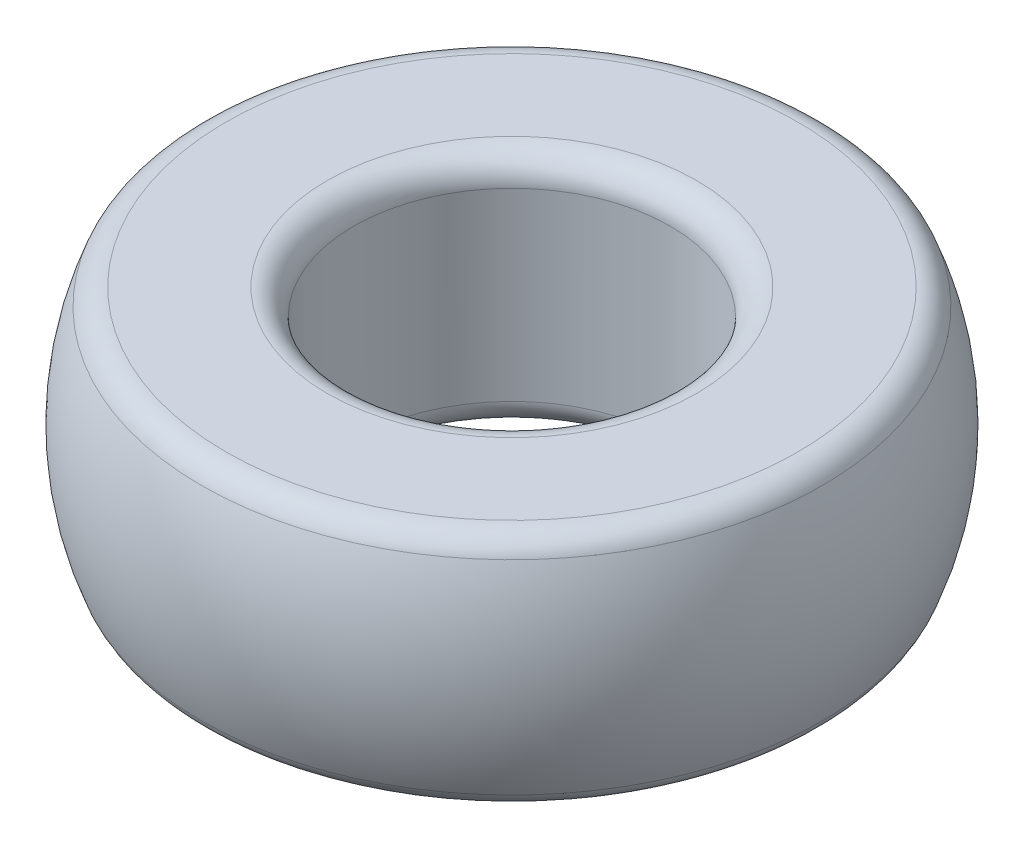
ISO-10303-21;
HEADER;
FILE_DESCRIPTION(('STEP AP214'),'2;1');
FILE_NAME('part.step','',(''),(''),'','','');
FILE_SCHEMA(('AUTOMOTIVE_DESIGN { 1 0 10303 214 1 1 1 1 }'));
ENDSEC;
DATA;
#1=APPLICATION_CONTEXT('core data for automotive mechanical design processes');
#2=APPLICATION_PROTOCOL_DEFINITION('international standard','automotive_design',2000,#1);
#3=PRODUCT_CONTEXT('',#1,'mechanical');
#4=PRODUCT('Part','Part','',(#3));
#5=PRODUCT_RELATED_PRODUCT_CATEGORY('part','',(#4));
#6=PRODUCT_DEFINITION_FORMATION('','',#4);
#7=PRODUCT_DEFINITION_CONTEXT('part definition',#1,'design');
#8=PRODUCT_DEFINITION('design','',#6,#7);
#9=PRODUCT_DEFINITION_SHAPE('','',#8);
#10=(LENGTH_UNIT() NAMED_UNIT(*) SI_UNIT(.MILLI.,.METRE.));
#11=(NAMED_UNIT(*) PLANE_ANGLE_UNIT() SI_UNIT($,.RADIAN.));
#12=(NAMED_UNIT(*) SI_UNIT($,.STERADIAN.) SOLID_ANGLE_UNIT());
#13=UNCERTAINTY_MEASURE_WITH_UNIT(LENGTH_MEASURE(1.E-05),#10,'distance_accuracy_value','');
#14=(GEOMETRIC_REPRESENTATION_CONTEXT(3) GLOBAL_UNCERTAINTY_ASSIGNED_CONTEXT((#13)) GLOBAL_UNIT_ASSIGNED_CONTEXT((#10,
#11,#12)) REPRESENTATION_CONTEXT('',''));
#15=CARTESIAN_POINT('',(0.,0.,0.));
#16=DIRECTION('',(0.,0.,1.));
#17=DIRECTION('',(1.,0.,0.));
#18=AXIS2_PLACEMENT_3D('',#15,#16,#17);
#19=CARTESIAN_POINT('',(6.,-4.5,0.));
#20=DIRECTION('',(0.,-1.,0.));
#21=DIRECTION('',(0.,0.,-1.));
#22=AXIS2_PLACEMENT_3D('',#19,#20,#21);
#23=PLANE('',#22);
#24=CARTESIAN_POINT('',(0.,-4.5,0.));
#25=DIRECTION('',(0.,-1.,0.));
#26=DIRECTION('',(0.,0.,-1.));
#27=AXIS2_PLACEMENT_3D('',#24,#25,#26);
#28=CIRCLE('',#27,7.);
#29=CARTESIAN_POINT('',(0.,-4.5,-7.));
#30=VERTEX_POINT('',#29);
#31=EDGE_CURVE('E52',#30,#30,#28,.F.);
#32=ORIENTED_EDGE('',*,*,#31,.T.);
#33=EDGE_LOOP('',(#32));
#34=FACE_BOUND('',#33,.T.);
#35=CARTESIAN_POINT('',(0.,-4.5,0.));
#36=DIRECTION('',(0.,-1.,0.));
#37=DIRECTION('',(0.,0.,-1.));
#38=AXIS2_PLACEMENT_3D('',#35,#36,#37);
#39=CIRCLE('',#38,10.8410819202146);
#40=CARTESIAN_POINT('',(0.,-4.5,-10.8410819202146));
#41=VERTEX_POINT('',#40);
#42=EDGE_CURVE('E55',#41,#41,#39,.T.);
#43=ORIENTED_EDGE('',*,*,#42,.T.);
#44=EDGE_LOOP('',(#43));
#45=FACE_BOUND('',#44,.T.);
#46=ADVANCED_FACE('F32',(#34,#45),#23,.T.);
#47=CARTESIAN_POINT('',(0.,-5.95711549427499,0.));
#48=DIRECTION('',(0.,-1.,0.));
#49=DIRECTION('',(0.,0.,-1.));
#50=AXIS2_PLACEMENT_3D('',#47,#48,#49);
#51=CYLINDRICAL_SURFACE('',#50,6.);
#52=CARTESIAN_POINT('',(0.,-3.5,0.));
#53=DIRECTION('',(0.,-1.,0.));
#54=DIRECTION('',(0.,0.,-1.));
#55=AXIS2_PLACEMENT_3D('',#52,#53,#54);
#56=CIRCLE('',#55,6.);
#57=CARTESIAN_POINT('',(0.,-3.5,-6.));
#58=VERTEX_POINT('',#57);
#59=EDGE_CURVE('E58',#58,#58,#56,.T.);
#60=ORIENTED_EDGE('',*,*,#59,.T.);
#61=EDGE_LOOP('',(#60));
#62=FACE_BOUND('',#61,.T.);
#63=CARTESIAN_POINT('',(0.,3.5,0.));
#64=DIRECTION('',(0.,1.,0.));
#65=DIRECTION('',(0.,0.,1.));
#66=AXIS2_PLACEMENT_3D('',#63,#64,#65);
#67=CIRCLE('',#66,6.);
#68=CARTESIAN_POINT('',(0.,3.5,6.));
#69=VERTEX_POINT('',#68);
#70=EDGE_CURVE('E61',#69,#69,#67,.T.);
#71=ORIENTED_EDGE('',*,*,#70,.T.);
#72=EDGE_LOOP('',(#71));
#73=FACE_BOUND('',#72,.T.);
#74=ADVANCED_FACE('F65',(#62,#73),#51,.F.);
#75=CARTESIAN_POINT('',(11.5,4.5,0.));
#76=DIRECTION('',(0.,1.,0.));
#77=DIRECTION('',(0.,0.,1.));
#78=AXIS2_PLACEMENT_3D('',#75,#76,#77);
#79=PLANE('',#78);
#80=CARTESIAN_POINT('',(0.,4.5,0.));
#81=DIRECTION('',(0.,1.,0.));
#82=DIRECTION('',(0.,0.,1.));
#83=AXIS2_PLACEMENT_3D('',#80,#81,#82);
#84=CIRCLE('',#83,7.);
#85=CARTESIAN_POINT('',(0.,4.5,7.));
#86=VERTEX_POINT('',#85);
#87=EDGE_CURVE('E10',#86,#86,#84,.F.);
#88=ORIENTED_EDGE('',*,*,#87,.T.);
#89=EDGE_LOOP('',(#88));
#90=FACE_BOUND('',#89,.T.);
#91=CARTESIAN_POINT('',(0.,4.5,0.));
#92=DIRECTION('',(0.,1.,0.));
#93=DIRECTION('',(0.,0.,1.));
#94=AXIS2_PLACEMENT_3D('',#91,#92,#93);
#95=CIRCLE('',#94,10.8410819202146);
#96=CARTESIAN_POINT('',(0.,4.5,10.8410819202146));
#97=VERTEX_POINT('',#96);
#98=EDGE_CURVE('E39',#97,#97,#95,.T.);
#99=ORIENTED_EDGE('',*,*,#98,.T.);
#100=EDGE_LOOP('',(#99));
#101=FACE_BOUND('',#100,.T.);
#102=ADVANCED_FACE('F85',(#90,#101),#79,.T.);
#103=CARTESIAN_POINT('',(0.,0.,0.));
#104=DIRECTION('',(0.,-1.,0.));
#105=DIRECTION('',(0.,0.,-1.));
#106=AXIS2_PLACEMENT_3D('',#103,#104,#105);
#107=DEGENERATE_TOROIDAL_SURFACE('',#106,1.87500000000002,10.625,.T.);
#108=CARTESIAN_POINT('',(0.,-3.86363636363636,0.));
#109=DIRECTION('',(0.,1.,0.));
#110=DIRECTION('',(0.,0.,1.));
#111=AXIS2_PLACEMENT_3D('',#108,#109,#110);
#112=CIRCLE('',#111,11.7726228989383);
#113=CARTESIAN_POINT('',(0.,-3.86363636363636,11.7726228989383));
#114=VERTEX_POINT('',#113);
#115=EDGE_CURVE('E43',#114,#114,#112,.T.);
#116=ORIENTED_EDGE('',*,*,#115,.T.);
#117=EDGE_LOOP('',(#116));
#118=FACE_BOUND('',#117,.T.);
#119=CARTESIAN_POINT('',(0.,3.86363636363637,0.));
#120=DIRECTION('',(0.,-1.,0.));
#121=DIRECTION('',(0.,0.,-1.));
#122=AXIS2_PLACEMENT_3D('',#119,#120,#121);
#123=CIRCLE('',#122,11.7726228989383);
#124=CARTESIAN_POINT('',(0.,3.86363636363637,-11.7726228989383));
#125=VERTEX_POINT('',#124);
#126=EDGE_CURVE('E47',#125,#125,#123,.T.);
#127=ORIENTED_EDGE('',*,*,#126,.T.);
#128=EDGE_LOOP('',(#127));
#129=FACE_BOUND('',#128,.T.);
#130=ADVANCED_FACE('F92',(#118,#129),#107,.T.);
#131=CARTESIAN_POINT('',(0.,-3.5,0.));
#132=DIRECTION('',(0.,-1.,0.));
#133=DIRECTION('',(0.,0.,-1.));
#134=AXIS2_PLACEMENT_3D('',#131,#132,#133);
#135=TOROIDAL_SURFACE('',#134,7.,1.);
#136=ORIENTED_EDGE('',*,*,#31,.F.);
#137=EDGE_LOOP('',(#136));
#138=FACE_BOUND('',#137,.T.);
#139=ORIENTED_EDGE('',*,*,#59,.F.);
#140=EDGE_LOOP('',(#139));
#141=FACE_BOUND('',#140,.T.);
#142=ADVANCED_FACE('F76',(#138,#141),#135,.T.);
#143=CARTESIAN_POINT('',(0.,-3.5,0.));
#144=DIRECTION('',(0.,-1.,0.));
#145=DIRECTION('',(0.,0.,-1.));
#146=AXIS2_PLACEMENT_3D('',#143,#144,#145);
#147=TOROIDAL_SURFACE('',#146,10.8410819202146,1.);
#148=ORIENTED_EDGE('',*,*,#115,.F.);
#149=EDGE_LOOP('',(#148));
#150=FACE_BOUND('',#149,.T.);
#151=ORIENTED_EDGE('',*,*,#42,.F.);
#152=EDGE_LOOP('',(#151));
#153=FACE_BOUND('',#152,.T.);
#154=ADVANCED_FACE('F70',(#150,#153),#147,.T.);
#155=CARTESIAN_POINT('',(0.,3.5,0.));
#156=DIRECTION('',(0.,1.,0.));
#157=DIRECTION('',(0.,0.,1.));
#158=AXIS2_PLACEMENT_3D('',#155,#156,#157);
#159=TOROIDAL_SURFACE('',#158,7.,1.);
#160=ORIENTED_EDGE('',*,*,#70,.F.);
#161=EDGE_LOOP('',(#160));
#162=FACE_BOUND('',#161,.T.);
#163=ORIENTED_EDGE('',*,*,#87,.F.);
#164=EDGE_LOOP('',(#163));
#165=FACE_BOUND('',#164,.T.);
#166=ADVANCED_FACE('F67',(#162,#165),#159,.T.);
#167=CARTESIAN_POINT('',(0.,3.5,0.));
#168=DIRECTION('',(0.,1.,0.));
#169=DIRECTION('',(0.,0.,1.));
#170=AXIS2_PLACEMENT_3D('',#167,#168,#169);
#171=TOROIDAL_SURFACE('',#170,10.8410819202146,1.);
#172=ORIENTED_EDGE('',*,*,#98,.F.);
#173=EDGE_LOOP('',(#172));
#174=FACE_BOUND('',#173,.T.);
#175=ORIENTED_EDGE('',*,*,#126,.F.);
#176=EDGE_LOOP('',(#175));
#177=FACE_BOUND('',#176,.T.);
#178=ADVANCED_FACE('F34',(#174,#177),#171,.T.);
#179=CLOSED_SHELL('',(#46,#74,#102,#130,#142,#154,#166,#178));
#180=MANIFOLD_SOLID_BREP('B2',#179);
#181=ADVANCED_BREP_SHAPE_REPRESENTATION('',(#18,#180),#14);
#182=SHAPE_DEFINITION_REPRESENTATION(#9,#181);
ENDSEC;
END-ISO-10303-21;
